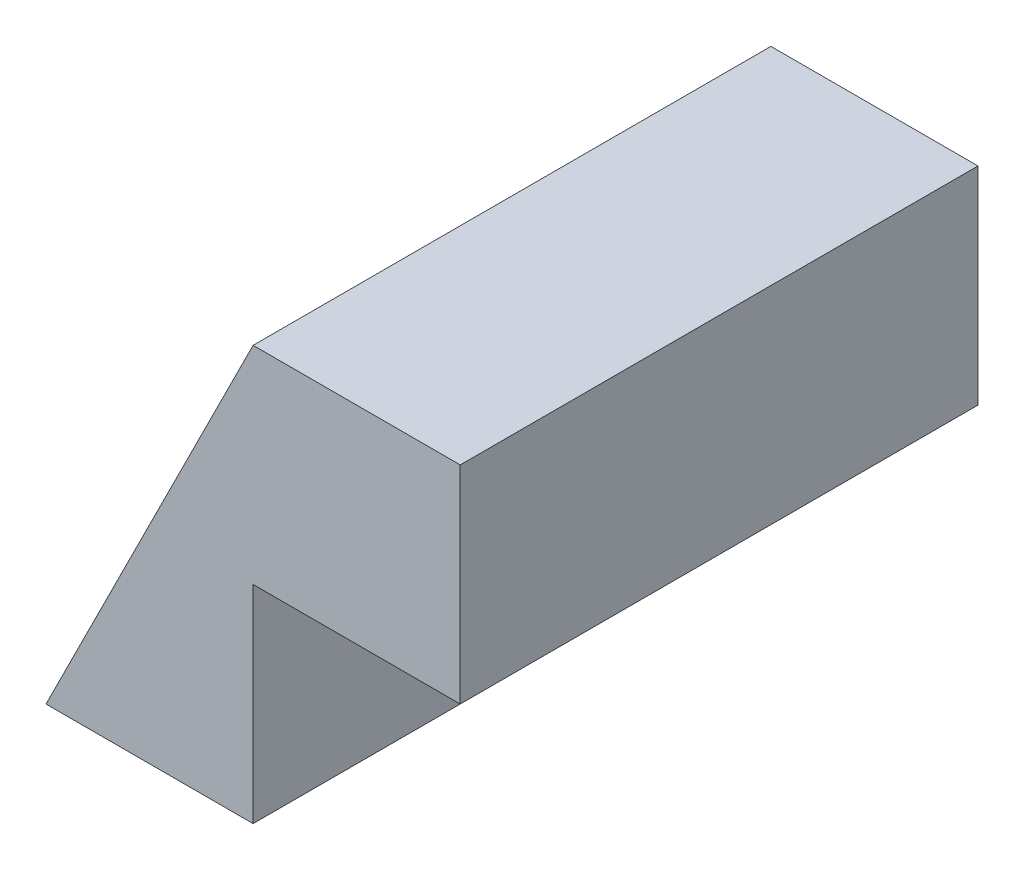
ISO-10303-21;
HEADER;
FILE_DESCRIPTION(('STEP AP214'),'2;1');
FILE_NAME('part.step','',(''),(''),'','','');
FILE_SCHEMA(('AUTOMOTIVE_DESIGN { 1 0 10303 214 1 1 1 1 }'));
ENDSEC;
DATA;
#1=APPLICATION_CONTEXT('core data for automotive mechanical design processes');
#2=APPLICATION_PROTOCOL_DEFINITION('international standard','automotive_design',2000,#1);
#3=PRODUCT_CONTEXT('',#1,'mechanical');
#4=PRODUCT('Part','Part','',(#3));
#5=PRODUCT_RELATED_PRODUCT_CATEGORY('part','',(#4));
#6=PRODUCT_DEFINITION_FORMATION('','',#4);
#7=PRODUCT_DEFINITION_CONTEXT('part definition',#1,'design');
#8=PRODUCT_DEFINITION('design','',#6,#7);
#9=PRODUCT_DEFINITION_SHAPE('','',#8);
#10=(LENGTH_UNIT() NAMED_UNIT(*) SI_UNIT(.MILLI.,.METRE.));
#11=(NAMED_UNIT(*) PLANE_ANGLE_UNIT() SI_UNIT($,.RADIAN.));
#12=(NAMED_UNIT(*) SI_UNIT($,.STERADIAN.) SOLID_ANGLE_UNIT());
#13=UNCERTAINTY_MEASURE_WITH_UNIT(LENGTH_MEASURE(1.E-05),#10,'distance_accuracy_value','');
#14=(GEOMETRIC_REPRESENTATION_CONTEXT(3) GLOBAL_UNCERTAINTY_ASSIGNED_CONTEXT((#13)) GLOBAL_UNIT_ASSIGNED_CONTEXT((#10,
#11,#12)) REPRESENTATION_CONTEXT('',''));
#15=CARTESIAN_POINT('',(0.,0.,0.));
#16=DIRECTION('',(0.,0.,1.));
#17=DIRECTION('',(1.,0.,0.));
#18=AXIS2_PLACEMENT_3D('',#15,#16,#17);
#19=CARTESIAN_POINT('',(-10.,-10.,25.));
#20=DIRECTION('',(0.,1.,0.));
#21=DIRECTION('',(0.,0.,1.));
#22=AXIS2_PLACEMENT_3D('',#19,#20,#21);
#23=PLANE('',#22);
#24=DIRECTION('',(1.,0.,0.));
#25=VECTOR('',#24,1.);
#26=CARTESIAN_POINT('',(-10.,-10.,0.));
#27=LINE('',#26,#25);
#28=CARTESIAN_POINT('',(-20.,-10.,0.));
#29=VERTEX_POINT('',#28);
#30=CARTESIAN_POINT('',(-10.,-10.,0.));
#31=VERTEX_POINT('',#30);
#32=EDGE_CURVE('E117',#29,#31,#27,.T.);
#33=ORIENTED_EDGE('',*,*,#32,.T.);
#34=DIRECTION('',(0.,0.,-1.));
#35=VECTOR('',#34,1.);
#36=CARTESIAN_POINT('',(-10.,-10.,25.));
#37=LINE('',#36,#35);
#38=CARTESIAN_POINT('',(-10.,-10.,25.));
#39=VERTEX_POINT('',#38);
#40=EDGE_CURVE('E11',#39,#31,#37,.T.);
#41=ORIENTED_EDGE('',*,*,#40,.F.);
#42=DIRECTION('',(1.,0.,0.));
#43=VECTOR('',#42,1.);
#44=CARTESIAN_POINT('',(-10.,-10.,25.));
#45=LINE('',#44,#43);
#46=CARTESIAN_POINT('',(-20.,-10.,25.));
#47=VERTEX_POINT('',#46);
#48=EDGE_CURVE('E127',#47,#39,#45,.T.);
#49=ORIENTED_EDGE('',*,*,#48,.F.);
#50=DIRECTION('',(0.,0.,-1.));
#51=VECTOR('',#50,1.);
#52=CARTESIAN_POINT('',(-20.,-10.,25.));
#53=LINE('',#52,#51);
#54=EDGE_CURVE('E113',#47,#29,#53,.T.);
#55=ORIENTED_EDGE('',*,*,#54,.T.);
#56=EDGE_LOOP('',(#33,#41,#49,#55));
#57=FACE_BOUND('',#56,.T.);
#58=ADVANCED_FACE('F33',(#57),#23,.F.);
#59=CARTESIAN_POINT('',(-10.,0.,25.));
#60=DIRECTION('',(-1.,0.,0.));
#61=DIRECTION('',(0.,0.,1.));
#62=AXIS2_PLACEMENT_3D('',#59,#60,#61);
#63=PLANE('',#62);
#64=DIRECTION('',(0.,1.,0.));
#65=VECTOR('',#64,1.);
#66=CARTESIAN_POINT('',(-10.,0.,0.));
#67=LINE('',#66,#65);
#68=CARTESIAN_POINT('',(-10.,0.,0.));
#69=VERTEX_POINT('',#68);
#70=EDGE_CURVE('E120',#31,#69,#67,.T.);
#71=ORIENTED_EDGE('',*,*,#70,.T.);
#72=DIRECTION('',(0.,0.,-1.));
#73=VECTOR('',#72,1.);
#74=CARTESIAN_POINT('',(-10.,0.,25.));
#75=LINE('',#74,#73);
#76=CARTESIAN_POINT('',(-10.,0.,25.));
#77=VERTEX_POINT('',#76);
#78=EDGE_CURVE('E41',#77,#69,#75,.T.);
#79=ORIENTED_EDGE('',*,*,#78,.F.);
#80=DIRECTION('',(0.,1.,0.));
#81=VECTOR('',#80,1.);
#82=CARTESIAN_POINT('',(-10.,0.,25.));
#83=LINE('',#82,#81);
#84=EDGE_CURVE('E86',#39,#77,#83,.T.);
#85=ORIENTED_EDGE('',*,*,#84,.F.);
#86=ORIENTED_EDGE('',*,*,#40,.T.);
#87=EDGE_LOOP('',(#71,#79,#85,#86));
#88=FACE_BOUND('',#87,.T.);
#89=ADVANCED_FACE('F151',(#88),#63,.F.);
#90=CARTESIAN_POINT('',(0.,0.,25.));
#91=DIRECTION('',(0.,1.,0.));
#92=DIRECTION('',(-1.,0.,0.));
#93=AXIS2_PLACEMENT_3D('',#90,#91,#92);
#94=PLANE('',#93);
#95=DIRECTION('',(1.,0.,0.));
#96=VECTOR('',#95,1.);
#97=CARTESIAN_POINT('',(0.,0.,0.));
#98=LINE('',#97,#96);
#99=CARTESIAN_POINT('',(0.,0.,0.));
#100=VERTEX_POINT('',#99);
#101=EDGE_CURVE('E122',#69,#100,#98,.T.);
#102=ORIENTED_EDGE('',*,*,#101,.T.);
#103=DIRECTION('',(0.,0.,-1.));
#104=VECTOR('',#103,1.);
#105=CARTESIAN_POINT('',(0.,0.,25.));
#106=LINE('',#105,#104);
#107=CARTESIAN_POINT('',(0.,0.,25.));
#108=VERTEX_POINT('',#107);
#109=EDGE_CURVE('E108',#108,#100,#106,.T.);
#110=ORIENTED_EDGE('',*,*,#109,.F.);
#111=DIRECTION('',(1.,0.,0.));
#112=VECTOR('',#111,1.);
#113=CARTESIAN_POINT('',(0.,0.,25.));
#114=LINE('',#113,#112);
#115=EDGE_CURVE('E99',#77,#108,#114,.T.);
#116=ORIENTED_EDGE('',*,*,#115,.F.);
#117=ORIENTED_EDGE('',*,*,#78,.T.);
#118=EDGE_LOOP('',(#102,#110,#116,#117));
#119=FACE_BOUND('',#118,.T.);
#120=ADVANCED_FACE('F133',(#119),#94,.F.);
#121=CARTESIAN_POINT('',(0.,10.,25.));
#122=DIRECTION('',(-1.,0.,0.));
#123=DIRECTION('',(0.,0.,1.));
#124=AXIS2_PLACEMENT_3D('',#121,#122,#123);
#125=PLANE('',#124);
#126=DIRECTION('',(0.,1.,0.));
#127=VECTOR('',#126,1.);
#128=CARTESIAN_POINT('',(0.,10.,0.));
#129=LINE('',#128,#127);
#130=CARTESIAN_POINT('',(0.,10.,0.));
#131=VERTEX_POINT('',#130);
#132=EDGE_CURVE('E107',#100,#131,#129,.T.);
#133=ORIENTED_EDGE('',*,*,#132,.T.);
#134=DIRECTION('',(0.,0.,-1.));
#135=VECTOR('',#134,1.);
#136=CARTESIAN_POINT('',(0.,10.,25.));
#137=LINE('',#136,#135);
#138=CARTESIAN_POINT('',(0.,10.,25.));
#139=VERTEX_POINT('',#138);
#140=EDGE_CURVE('E104',#139,#131,#137,.T.);
#141=ORIENTED_EDGE('',*,*,#140,.F.);
#142=DIRECTION('',(0.,1.,0.));
#143=VECTOR('',#142,1.);
#144=CARTESIAN_POINT('',(0.,10.,25.));
#145=LINE('',#144,#143);
#146=EDGE_CURVE('E93',#108,#139,#145,.T.);
#147=ORIENTED_EDGE('',*,*,#146,.F.);
#148=ORIENTED_EDGE('',*,*,#109,.T.);
#149=EDGE_LOOP('',(#133,#141,#147,#148));
#150=FACE_BOUND('',#149,.T.);
#151=ADVANCED_FACE('F105',(#150),#125,.F.);
#152=CARTESIAN_POINT('',(-10.,10.,25.));
#153=DIRECTION('',(0.,-1.,0.));
#154=DIRECTION('',(1.,0.,0.));
#155=AXIS2_PLACEMENT_3D('',#152,#153,#154);
#156=PLANE('',#155);
#157=DIRECTION('',(-1.,0.,0.));
#158=VECTOR('',#157,1.);
#159=CARTESIAN_POINT('',(-10.,10.,0.));
#160=LINE('',#159,#158);
#161=CARTESIAN_POINT('',(-10.,10.,0.));
#162=VERTEX_POINT('',#161);
#163=EDGE_CURVE('E72',#131,#162,#160,.T.);
#164=ORIENTED_EDGE('',*,*,#163,.T.);
#165=DIRECTION('',(0.,0.,-1.));
#166=VECTOR('',#165,1.);
#167=CARTESIAN_POINT('',(-10.,10.,25.));
#168=LINE('',#167,#166);
#169=CARTESIAN_POINT('',(-10.,10.,25.));
#170=VERTEX_POINT('',#169);
#171=EDGE_CURVE('E109',#170,#162,#168,.T.);
#172=ORIENTED_EDGE('',*,*,#171,.F.);
#173=DIRECTION('',(-1.,0.,0.));
#174=VECTOR('',#173,1.);
#175=CARTESIAN_POINT('',(-10.,10.,25.));
#176=LINE('',#175,#174);
#177=EDGE_CURVE('E97',#139,#170,#176,.T.);
#178=ORIENTED_EDGE('',*,*,#177,.F.);
#179=ORIENTED_EDGE('',*,*,#140,.T.);
#180=EDGE_LOOP('',(#164,#172,#178,#179));
#181=FACE_BOUND('',#180,.T.);
#182=ADVANCED_FACE('F111',(#181),#156,.F.);
#183=CARTESIAN_POINT('',(-20.,-10.,25.));
#184=DIRECTION('',(0.894427190999916,-0.447213595499958,0.));
#185=DIRECTION('',(0.447213595499958,0.894427190999916,0.));
#186=AXIS2_PLACEMENT_3D('',#183,#184,#185);
#187=PLANE('',#186);
#188=DIRECTION('',(-0.447213595499958,-0.894427190999916,0.));
#189=VECTOR('',#188,1.);
#190=CARTESIAN_POINT('',(-20.,-10.,0.));
#191=LINE('',#190,#189);
#192=EDGE_CURVE('E78',#162,#29,#191,.T.);
#193=ORIENTED_EDGE('',*,*,#192,.T.);
#194=ORIENTED_EDGE('',*,*,#54,.F.);
#195=DIRECTION('',(-0.447213595499958,-0.894427190999916,0.));
#196=VECTOR('',#195,1.);
#197=CARTESIAN_POINT('',(-20.,-10.,25.));
#198=LINE('',#197,#196);
#199=EDGE_CURVE('E49',#170,#47,#198,.T.);
#200=ORIENTED_EDGE('',*,*,#199,.F.);
#201=ORIENTED_EDGE('',*,*,#171,.T.);
#202=EDGE_LOOP('',(#193,#194,#200,#201));
#203=FACE_BOUND('',#202,.T.);
#204=ADVANCED_FACE('F140',(#203),#187,.F.);
#205=CARTESIAN_POINT('',(0.,0.,25.));
#206=DIRECTION('',(0.,0.,1.));
#207=DIRECTION('',(1.,0.,0.));
#208=AXIS2_PLACEMENT_3D('',#205,#206,#207);
#209=PLANE('',#208);
#210=ORIENTED_EDGE('',*,*,#48,.T.);
#211=ORIENTED_EDGE('',*,*,#84,.T.);
#212=ORIENTED_EDGE('',*,*,#115,.T.);
#213=ORIENTED_EDGE('',*,*,#146,.T.);
#214=ORIENTED_EDGE('',*,*,#177,.T.);
#215=ORIENTED_EDGE('',*,*,#199,.T.);
#216=EDGE_LOOP('',(#210,#211,#212,#213,#214,#215));
#217=FACE_BOUND('',#216,.T.);
#218=ADVANCED_FACE('F95',(#217),#209,.T.);
#219=CARTESIAN_POINT('',(0.,0.,0.));
#220=DIRECTION('',(0.,0.,1.));
#221=DIRECTION('',(1.,0.,0.));
#222=AXIS2_PLACEMENT_3D('',#219,#220,#221);
#223=PLANE('',#222);
#224=ORIENTED_EDGE('',*,*,#32,.F.);
#225=ORIENTED_EDGE('',*,*,#192,.F.);
#226=ORIENTED_EDGE('',*,*,#163,.F.);
#227=ORIENTED_EDGE('',*,*,#132,.F.);
#228=ORIENTED_EDGE('',*,*,#101,.F.);
#229=ORIENTED_EDGE('',*,*,#70,.F.);
#230=EDGE_LOOP('',(#224,#225,#226,#227,#228,#229));
#231=FACE_BOUND('',#230,.T.);
#232=ADVANCED_FACE('F136',(#231),#223,.F.);
#233=CLOSED_SHELL('',(#58,#89,#120,#151,#182,#204,#218,#232));
#234=MANIFOLD_SOLID_BREP('B2',#233);
#235=ADVANCED_BREP_SHAPE_REPRESENTATION('',(#18,#234),#14);
#236=SHAPE_DEFINITION_REPRESENTATION(#9,#235);
ENDSEC;
END-ISO-10303-21;
